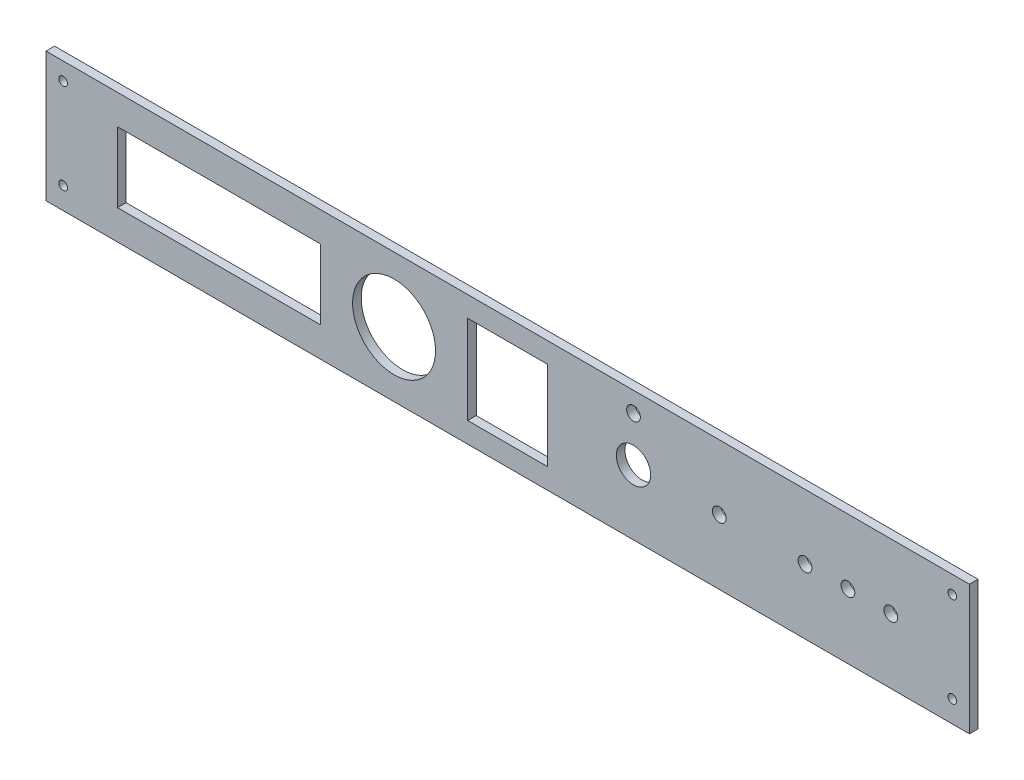
ISO-10303-21;
HEADER;
FILE_DESCRIPTION(('STEP AP214'),'2;1');
FILE_NAME('part.step','',(''),(''),'','','');
FILE_SCHEMA(('AUTOMOTIVE_DESIGN { 1 0 10303 214 1 1 1 1 }'));
ENDSEC;
DATA;
#1=APPLICATION_CONTEXT('core data for automotive mechanical design processes');
#2=APPLICATION_PROTOCOL_DEFINITION('international standard','automotive_design',2000,#1);
#3=PRODUCT_CONTEXT('',#1,'mechanical');
#4=PRODUCT('Part','Part','',(#3));
#5=PRODUCT_RELATED_PRODUCT_CATEGORY('part','',(#4));
#6=PRODUCT_DEFINITION_FORMATION('','',#4);
#7=PRODUCT_DEFINITION_CONTEXT('part definition',#1,'design');
#8=PRODUCT_DEFINITION('design','',#6,#7);
#9=PRODUCT_DEFINITION_SHAPE('','',#8);
#10=(LENGTH_UNIT() NAMED_UNIT(*) SI_UNIT(.MILLI.,.METRE.));
#11=(NAMED_UNIT(*) PLANE_ANGLE_UNIT() SI_UNIT($,.RADIAN.));
#12=(NAMED_UNIT(*) SI_UNIT($,.STERADIAN.) SOLID_ANGLE_UNIT());
#13=UNCERTAINTY_MEASURE_WITH_UNIT(LENGTH_MEASURE(1.E-05),#10,'distance_accuracy_value','');
#14=(GEOMETRIC_REPRESENTATION_CONTEXT(3) GLOBAL_UNCERTAINTY_ASSIGNED_CONTEXT((#13)) GLOBAL_UNIT_ASSIGNED_CONTEXT((#10,
#11,#12)) REPRESENTATION_CONTEXT('',''));
#15=CARTESIAN_POINT('',(0.,0.,0.));
#16=DIRECTION('',(0.,0.,1.));
#17=DIRECTION('',(1.,0.,0.));
#18=AXIS2_PLACEMENT_3D('',#15,#16,#17);
#19=CARTESIAN_POINT('',(0.,0.,3.));
#20=DIRECTION('',(0.,0.,1.));
#21=DIRECTION('',(1.,0.,0.));
#22=AXIS2_PLACEMENT_3D('',#19,#20,#21);
#23=PLANE('',#22);
#24=CARTESIAN_POINT('',(104.,0.,3.));
#25=DIRECTION('',(0.,0.,1.));
#26=DIRECTION('',(1.,0.,0.));
#27=AXIS2_PLACEMENT_3D('',#24,#25,#26);
#28=CIRCLE('',#27,2.4);
#29=CARTESIAN_POINT('',(106.4,0.,3.));
#30=VERTEX_POINT('',#29);
#31=EDGE_CURVE('E360',#30,#30,#28,.T.);
#32=ORIENTED_EDGE('',*,*,#31,.F.);
#33=EDGE_LOOP('',(#32));
#34=FACE_BOUND('',#33,.T.);
#35=CARTESIAN_POINT('',(134.,0.,3.));
#36=DIRECTION('',(0.,0.,1.));
#37=DIRECTION('',(1.,0.,0.));
#38=AXIS2_PLACEMENT_3D('',#35,#36,#37);
#39=CIRCLE('',#38,2.4);
#40=CARTESIAN_POINT('',(136.4,0.,3.));
#41=VERTEX_POINT('',#40);
#42=EDGE_CURVE('E366',#41,#41,#39,.T.);
#43=ORIENTED_EDGE('',*,*,#42,.F.);
#44=EDGE_LOOP('',(#43));
#45=FACE_BOUND('',#44,.T.);
#46=CARTESIAN_POINT('',(-39.75,0.,3.));
#47=DIRECTION('',(0.,0.,1.));
#48=DIRECTION('',(1.,0.,0.));
#49=AXIS2_PLACEMENT_3D('',#46,#47,#48);
#50=CIRCLE('',#49,14.5);
#51=CARTESIAN_POINT('',(-25.25,0.,3.));
#52=VERTEX_POINT('',#51);
#53=EDGE_CURVE('E372',#52,#52,#50,.T.);
#54=ORIENTED_EDGE('',*,*,#53,.F.);
#55=EDGE_LOOP('',(#54));
#56=FACE_BOUND('',#55,.T.);
#57=DIRECTION('',(1.,0.,0.));
#58=VECTOR('',#57,1.);
#59=CARTESIAN_POINT('',(0.,15.5,3.));
#60=LINE('',#59,#58);
#61=CARTESIAN_POINT('',(-14.,15.5,3.));
#62=VERTEX_POINT('',#61);
#63=CARTESIAN_POINT('',(14.,15.5,3.));
#64=VERTEX_POINT('',#63);
#65=EDGE_CURVE('E174',#62,#64,#60,.T.);
#66=ORIENTED_EDGE('',*,*,#65,.T.);
#67=DIRECTION('',(0.,-1.,0.));
#68=VECTOR('',#67,1.);
#69=CARTESIAN_POINT('',(14.,0.,3.));
#70=LINE('',#69,#68);
#71=CARTESIAN_POINT('',(14.,-15.5,3.));
#72=VERTEX_POINT('',#71);
#73=EDGE_CURVE('E78',#64,#72,#70,.T.);
#74=ORIENTED_EDGE('',*,*,#73,.T.);
#75=DIRECTION('',(1.,0.,0.));
#76=VECTOR('',#75,1.);
#77=CARTESIAN_POINT('',(0.,-15.5,3.));
#78=LINE('',#77,#76);
#79=CARTESIAN_POINT('',(-14.,-15.5,3.));
#80=VERTEX_POINT('',#79);
#81=EDGE_CURVE('E164',#80,#72,#78,.T.);
#82=ORIENTED_EDGE('',*,*,#81,.F.);
#83=DIRECTION('',(0.,-1.,0.));
#84=VECTOR('',#83,1.);
#85=CARTESIAN_POINT('',(-14.,0.,3.));
#86=LINE('',#85,#84);
#87=EDGE_CURVE('E169',#62,#80,#86,.T.);
#88=ORIENTED_EDGE('',*,*,#87,.F.);
#89=EDGE_LOOP('',(#66,#74,#82,#88));
#90=FACE_BOUND('',#89,.T.);
#91=CARTESIAN_POINT('',(155.5,16.55,3.));
#92=DIRECTION('',(0.,0.,1.));
#93=DIRECTION('',(1.,0.,0.));
#94=AXIS2_PLACEMENT_3D('',#91,#92,#93);
#95=CIRCLE('',#94,1.49999999999994);
#96=CARTESIAN_POINT('',(157.,16.55,3.));
#97=VERTEX_POINT('',#96);
#98=EDGE_CURVE('E350',#97,#97,#95,.F.);
#99=ORIENTED_EDGE('',*,*,#98,.T.);
#100=EDGE_LOOP('',(#99));
#101=FACE_BOUND('',#100,.T.);
#102=CARTESIAN_POINT('',(74.,0.,3.));
#103=DIRECTION('',(0.,0.,1.));
#104=DIRECTION('',(1.,0.,0.));
#105=AXIS2_PLACEMENT_3D('',#102,#103,#104);
#106=CIRCLE('',#105,2.4);
#107=CARTESIAN_POINT('',(76.4,0.,3.));
#108=VERTEX_POINT('',#107);
#109=EDGE_CURVE('E462',#108,#108,#106,.T.);
#110=ORIENTED_EDGE('',*,*,#109,.F.);
#111=EDGE_LOOP('',(#110));
#112=FACE_BOUND('',#111,.T.);
#113=CARTESIAN_POINT('',(-155.5,-15.05,3.));
#114=DIRECTION('',(0.,0.,1.));
#115=DIRECTION('',(1.,0.,0.));
#116=AXIS2_PLACEMENT_3D('',#113,#114,#115);
#117=CIRCLE('',#116,1.49999999999994);
#118=CARTESIAN_POINT('',(-154.,-15.05,3.));
#119=VERTEX_POINT('',#118);
#120=EDGE_CURVE('E466',#119,#119,#117,.T.);
#121=ORIENTED_EDGE('',*,*,#120,.F.);
#122=EDGE_LOOP('',(#121));
#123=FACE_BOUND('',#122,.T.);
#124=CARTESIAN_POINT('',(-155.5,16.55,3.));
#125=DIRECTION('',(0.,0.,1.));
#126=DIRECTION('',(1.,0.,0.));
#127=AXIS2_PLACEMENT_3D('',#124,#125,#126);
#128=CIRCLE('',#127,1.49999999999994);
#129=CARTESIAN_POINT('',(-154.,16.55,3.));
#130=VERTEX_POINT('',#129);
#131=EDGE_CURVE('E469',#130,#130,#128,.T.);
#132=ORIENTED_EDGE('',*,*,#131,.F.);
#133=EDGE_LOOP('',(#132));
#134=FACE_BOUND('',#133,.T.);
#135=DIRECTION('',(1.,0.,0.));
#136=VECTOR('',#135,1.);
#137=CARTESIAN_POINT('',(0.,-12.25,3.));
#138=LINE('',#137,#136);
#139=CARTESIAN_POINT('',(-136.5,-12.25,3.));
#140=VERTEX_POINT('',#139);
#141=CARTESIAN_POINT('',(-65.5,-12.25,3.));
#142=VERTEX_POINT('',#141);
#143=EDGE_CURVE('E86',#140,#142,#138,.T.);
#144=ORIENTED_EDGE('',*,*,#143,.F.);
#145=DIRECTION('',(0.,-1.,0.));
#146=VECTOR('',#145,1.);
#147=CARTESIAN_POINT('',(-136.5,0.,3.));
#148=LINE('',#147,#146);
#149=CARTESIAN_POINT('',(-136.5,12.25,3.));
#150=VERTEX_POINT('',#149);
#151=EDGE_CURVE('E212',#150,#140,#148,.T.);
#152=ORIENTED_EDGE('',*,*,#151,.F.);
#153=DIRECTION('',(1.,0.,0.));
#154=VECTOR('',#153,1.);
#155=CARTESIAN_POINT('',(0.,12.25,3.));
#156=LINE('',#155,#154);
#157=CARTESIAN_POINT('',(-65.5,12.25,3.));
#158=VERTEX_POINT('',#157);
#159=EDGE_CURVE('E178',#150,#158,#156,.T.);
#160=ORIENTED_EDGE('',*,*,#159,.T.);
#161=DIRECTION('',(0.,-1.,0.));
#162=VECTOR('',#161,1.);
#163=CARTESIAN_POINT('',(-65.5,0.,3.));
#164=LINE('',#163,#162);
#165=EDGE_CURVE('E175',#158,#142,#164,.T.);
#166=ORIENTED_EDGE('',*,*,#165,.T.);
#167=EDGE_LOOP('',(#144,#152,#160,#166));
#168=FACE_BOUND('',#167,.T.);
#169=DIRECTION('',(0.,1.,0.));
#170=VECTOR('',#169,1.);
#171=CARTESIAN_POINT('',(161.5,22.67,3.));
#172=LINE('',#171,#170);
#173=CARTESIAN_POINT('',(161.5,-22.67,3.));
#174=VERTEX_POINT('',#173);
#175=CARTESIAN_POINT('',(161.5,22.67,3.));
#176=VERTEX_POINT('',#175);
#177=EDGE_CURVE('E224',#174,#176,#172,.T.);
#178=ORIENTED_EDGE('',*,*,#177,.T.);
#179=DIRECTION('',(-1.,0.,0.));
#180=VECTOR('',#179,1.);
#181=CARTESIAN_POINT('',(-161.5,22.67,3.));
#182=LINE('',#181,#180);
#183=CARTESIAN_POINT('',(-161.5,22.67,3.));
#184=VERTEX_POINT('',#183);
#185=EDGE_CURVE('E227',#176,#184,#182,.T.);
#186=ORIENTED_EDGE('',*,*,#185,.T.);
#187=DIRECTION('',(0.,-1.,0.));
#188=VECTOR('',#187,1.);
#189=CARTESIAN_POINT('',(-161.5,22.67,3.));
#190=LINE('',#189,#188);
#191=CARTESIAN_POINT('',(-161.5,-22.67,3.));
#192=VERTEX_POINT('',#191);
#193=EDGE_CURVE('E230',#184,#192,#190,.T.);
#194=ORIENTED_EDGE('',*,*,#193,.T.);
#195=DIRECTION('',(1.,0.,0.));
#196=VECTOR('',#195,1.);
#197=CARTESIAN_POINT('',(-161.5,-22.67,3.));
#198=LINE('',#197,#196);
#199=EDGE_CURVE('E232',#192,#174,#198,.T.);
#200=ORIENTED_EDGE('',*,*,#199,.T.);
#201=EDGE_LOOP('',(#178,#186,#194,#200));
#202=FACE_BOUND('',#201,.T.);
#203=CARTESIAN_POINT('',(119.,0.,3.));
#204=DIRECTION('',(0.,0.,1.));
#205=DIRECTION('',(1.,0.,0.));
#206=AXIS2_PLACEMENT_3D('',#203,#204,#205);
#207=CIRCLE('',#206,2.4);
#208=CARTESIAN_POINT('',(121.4,0.,3.));
#209=VERTEX_POINT('',#208);
#210=EDGE_CURVE('E376',#209,#209,#207,.T.);
#211=ORIENTED_EDGE('',*,*,#210,.F.);
#212=EDGE_LOOP('',(#211));
#213=FACE_BOUND('',#212,.T.);
#214=CARTESIAN_POINT('',(44.,15.67,3.));
#215=DIRECTION('',(0.,0.,1.));
#216=DIRECTION('',(1.,0.,0.));
#217=AXIS2_PLACEMENT_3D('',#214,#215,#216);
#218=CIRCLE('',#217,2.4);
#219=CARTESIAN_POINT('',(46.4,15.67,3.));
#220=VERTEX_POINT('',#219);
#221=EDGE_CURVE('E197',#220,#220,#218,.T.);
#222=ORIENTED_EDGE('',*,*,#221,.F.);
#223=EDGE_LOOP('',(#222));
#224=FACE_BOUND('',#223,.T.);
#225=CARTESIAN_POINT('',(44.,0.,3.));
#226=DIRECTION('',(0.,0.,1.));
#227=DIRECTION('',(1.,0.,0.));
#228=AXIS2_PLACEMENT_3D('',#225,#226,#227);
#229=CIRCLE('',#228,6.);
#230=CARTESIAN_POINT('',(50.,0.,3.));
#231=VERTEX_POINT('',#230);
#232=EDGE_CURVE('E161',#231,#231,#229,.T.);
#233=ORIENTED_EDGE('',*,*,#232,.F.);
#234=EDGE_LOOP('',(#233));
#235=FACE_BOUND('',#234,.T.);
#236=CARTESIAN_POINT('',(155.5,-15.05,3.));
#237=DIRECTION('',(0.,0.,1.));
#238=DIRECTION('',(1.,0.,0.));
#239=AXIS2_PLACEMENT_3D('',#236,#237,#238);
#240=CIRCLE('',#239,1.49999999999994);
#241=CARTESIAN_POINT('',(157.,-15.05,3.));
#242=VERTEX_POINT('',#241);
#243=EDGE_CURVE('E349',#242,#242,#240,.F.);
#244=ORIENTED_EDGE('',*,*,#243,.T.);
#245=EDGE_LOOP('',(#244));
#246=FACE_BOUND('',#245,.T.);
#247=ADVANCED_FACE('F63',(#34,#45,#56,#90,#101,#112,#123,#134,#168,#202,#213,#224,#235,#246),
#23,.T.);
#248=CARTESIAN_POINT('',(0.,0.,0.));
#249=DIRECTION('',(0.,0.,1.));
#250=DIRECTION('',(1.,0.,0.));
#251=AXIS2_PLACEMENT_3D('',#248,#249,#250);
#252=PLANE('',#251);
#253=CARTESIAN_POINT('',(104.,0.,0.));
#254=DIRECTION('',(0.,0.,1.));
#255=DIRECTION('',(1.,0.,0.));
#256=AXIS2_PLACEMENT_3D('',#253,#254,#255);
#257=CIRCLE('',#256,2.4);
#258=CARTESIAN_POINT('',(106.4,0.,0.));
#259=VERTEX_POINT('',#258);
#260=EDGE_CURVE('E363',#259,#259,#257,.T.);
#261=ORIENTED_EDGE('',*,*,#260,.T.);
#262=EDGE_LOOP('',(#261));
#263=FACE_BOUND('',#262,.T.);
#264=CARTESIAN_POINT('',(134.,0.,0.));
#265=DIRECTION('',(0.,0.,1.));
#266=DIRECTION('',(1.,0.,0.));
#267=AXIS2_PLACEMENT_3D('',#264,#265,#266);
#268=CIRCLE('',#267,2.4);
#269=CARTESIAN_POINT('',(136.4,0.,0.));
#270=VERTEX_POINT('',#269);
#271=EDGE_CURVE('E369',#270,#270,#268,.T.);
#272=ORIENTED_EDGE('',*,*,#271,.T.);
#273=EDGE_LOOP('',(#272));
#274=FACE_BOUND('',#273,.T.);
#275=CARTESIAN_POINT('',(-39.75,0.,0.));
#276=DIRECTION('',(0.,0.,1.));
#277=DIRECTION('',(1.,0.,0.));
#278=AXIS2_PLACEMENT_3D('',#275,#276,#277);
#279=CIRCLE('',#278,14.5);
#280=CARTESIAN_POINT('',(-25.25,0.,0.));
#281=VERTEX_POINT('',#280);
#282=EDGE_CURVE('E353',#281,#281,#279,.T.);
#283=ORIENTED_EDGE('',*,*,#282,.T.);
#284=EDGE_LOOP('',(#283));
#285=FACE_BOUND('',#284,.T.);
#286=CARTESIAN_POINT('',(155.5,16.55,0.));
#287=DIRECTION('',(0.,0.,1.));
#288=DIRECTION('',(1.,0.,0.));
#289=AXIS2_PLACEMENT_3D('',#286,#287,#288);
#290=CIRCLE('',#289,1.49999999999994);
#291=CARTESIAN_POINT('',(157.,16.55,0.));
#292=VERTEX_POINT('',#291);
#293=EDGE_CURVE('E356',#292,#292,#290,.F.);
#294=ORIENTED_EDGE('',*,*,#293,.F.);
#295=EDGE_LOOP('',(#294));
#296=FACE_BOUND('',#295,.T.);
#297=DIRECTION('',(0.,1.,0.));
#298=VECTOR('',#297,1.);
#299=CARTESIAN_POINT('',(161.5,22.67,0.));
#300=LINE('',#299,#298);
#301=CARTESIAN_POINT('',(161.5,-22.67,0.));
#302=VERTEX_POINT('',#301);
#303=CARTESIAN_POINT('',(161.5,22.67,0.));
#304=VERTEX_POINT('',#303);
#305=EDGE_CURVE('E218',#302,#304,#300,.T.);
#306=ORIENTED_EDGE('',*,*,#305,.F.);
#307=DIRECTION('',(1.,0.,0.));
#308=VECTOR('',#307,1.);
#309=CARTESIAN_POINT('',(-161.5,-22.67,0.));
#310=LINE('',#309,#308);
#311=CARTESIAN_POINT('',(-161.5,-22.67,0.));
#312=VERTEX_POINT('',#311);
#313=EDGE_CURVE('E228',#312,#302,#310,.T.);
#314=ORIENTED_EDGE('',*,*,#313,.F.);
#315=DIRECTION('',(0.,-1.,0.));
#316=VECTOR('',#315,1.);
#317=CARTESIAN_POINT('',(-161.5,22.67,0.));
#318=LINE('',#317,#316);
#319=CARTESIAN_POINT('',(-161.5,22.67,0.));
#320=VERTEX_POINT('',#319);
#321=EDGE_CURVE('E239',#320,#312,#318,.T.);
#322=ORIENTED_EDGE('',*,*,#321,.F.);
#323=DIRECTION('',(-1.,0.,0.));
#324=VECTOR('',#323,1.);
#325=CARTESIAN_POINT('',(-161.5,22.67,0.));
#326=LINE('',#325,#324);
#327=EDGE_CURVE('E237',#304,#320,#326,.T.);
#328=ORIENTED_EDGE('',*,*,#327,.F.);
#329=EDGE_LOOP('',(#306,#314,#322,#328));
#330=FACE_BOUND('',#329,.T.);
#331=DIRECTION('',(0.,-1.,0.));
#332=VECTOR('',#331,1.);
#333=CARTESIAN_POINT('',(-136.5,0.,0.));
#334=LINE('',#333,#332);
#335=CARTESIAN_POINT('',(-136.5,12.25,0.));
#336=VERTEX_POINT('',#335);
#337=CARTESIAN_POINT('',(-136.5,-12.25,0.));
#338=VERTEX_POINT('',#337);
#339=EDGE_CURVE('E203',#336,#338,#334,.T.);
#340=ORIENTED_EDGE('',*,*,#339,.T.);
#341=DIRECTION('',(1.,0.,0.));
#342=VECTOR('',#341,1.);
#343=CARTESIAN_POINT('',(0.,-12.25,0.));
#344=LINE('',#343,#342);
#345=CARTESIAN_POINT('',(-65.5,-12.25,0.));
#346=VERTEX_POINT('',#345);
#347=EDGE_CURVE('E206',#338,#346,#344,.T.);
#348=ORIENTED_EDGE('',*,*,#347,.T.);
#349=DIRECTION('',(0.,-1.,0.));
#350=VECTOR('',#349,1.);
#351=CARTESIAN_POINT('',(-65.5,0.,0.));
#352=LINE('',#351,#350);
#353=CARTESIAN_POINT('',(-65.5,12.25,0.));
#354=VERTEX_POINT('',#353);
#355=EDGE_CURVE('E198',#354,#346,#352,.T.);
#356=ORIENTED_EDGE('',*,*,#355,.F.);
#357=DIRECTION('',(1.,0.,0.));
#358=VECTOR('',#357,1.);
#359=CARTESIAN_POINT('',(0.,12.25,0.));
#360=LINE('',#359,#358);
#361=EDGE_CURVE('E200',#336,#354,#360,.T.);
#362=ORIENTED_EDGE('',*,*,#361,.F.);
#363=EDGE_LOOP('',(#340,#348,#356,#362));
#364=FACE_BOUND('',#363,.T.);
#365=CARTESIAN_POINT('',(-155.5,16.55,0.));
#366=DIRECTION('',(0.,0.,1.));
#367=DIRECTION('',(1.,0.,0.));
#368=AXIS2_PLACEMENT_3D('',#365,#366,#367);
#369=CIRCLE('',#368,1.49999999999994);
#370=CARTESIAN_POINT('',(-154.,16.55,0.));
#371=VERTEX_POINT('',#370);
#372=EDGE_CURVE('E324',#371,#371,#369,.T.);
#373=ORIENTED_EDGE('',*,*,#372,.T.);
#374=EDGE_LOOP('',(#373));
#375=FACE_BOUND('',#374,.T.);
#376=CARTESIAN_POINT('',(-155.5,-15.05,0.));
#377=DIRECTION('',(0.,0.,1.));
#378=DIRECTION('',(1.,0.,0.));
#379=AXIS2_PLACEMENT_3D('',#376,#377,#378);
#380=CIRCLE('',#379,1.49999999999994);
#381=CARTESIAN_POINT('',(-154.,-15.05,0.));
#382=VERTEX_POINT('',#381);
#383=EDGE_CURVE('E328',#382,#382,#380,.T.);
#384=ORIENTED_EDGE('',*,*,#383,.T.);
#385=EDGE_LOOP('',(#384));
#386=FACE_BOUND('',#385,.T.);
#387=CARTESIAN_POINT('',(74.,0.,0.));
#388=DIRECTION('',(0.,0.,1.));
#389=DIRECTION('',(1.,0.,0.));
#390=AXIS2_PLACEMENT_3D('',#387,#388,#389);
#391=CIRCLE('',#390,2.4);
#392=CARTESIAN_POINT('',(76.4,0.,0.));
#393=VERTEX_POINT('',#392);
#394=EDGE_CURVE('E332',#393,#393,#391,.T.);
#395=ORIENTED_EDGE('',*,*,#394,.T.);
#396=EDGE_LOOP('',(#395));
#397=FACE_BOUND('',#396,.T.);
#398=CARTESIAN_POINT('',(119.,0.,0.));
#399=DIRECTION('',(0.,0.,1.));
#400=DIRECTION('',(1.,0.,0.));
#401=AXIS2_PLACEMENT_3D('',#398,#399,#400);
#402=CIRCLE('',#401,2.4);
#403=CARTESIAN_POINT('',(121.4,0.,0.));
#404=VERTEX_POINT('',#403);
#405=EDGE_CURVE('E336',#404,#404,#402,.T.);
#406=ORIENTED_EDGE('',*,*,#405,.T.);
#407=EDGE_LOOP('',(#406));
#408=FACE_BOUND('',#407,.T.);
#409=CARTESIAN_POINT('',(44.,15.67,0.));
#410=DIRECTION('',(0.,0.,1.));
#411=DIRECTION('',(1.,0.,0.));
#412=AXIS2_PLACEMENT_3D('',#409,#410,#411);
#413=CIRCLE('',#412,2.4);
#414=CARTESIAN_POINT('',(46.4,15.67,0.));
#415=VERTEX_POINT('',#414);
#416=EDGE_CURVE('E340',#415,#415,#413,.T.);
#417=ORIENTED_EDGE('',*,*,#416,.T.);
#418=EDGE_LOOP('',(#417));
#419=FACE_BOUND('',#418,.T.);
#420=CARTESIAN_POINT('',(44.,0.,0.));
#421=DIRECTION('',(0.,0.,1.));
#422=DIRECTION('',(1.,0.,0.));
#423=AXIS2_PLACEMENT_3D('',#420,#421,#422);
#424=CIRCLE('',#423,6.);
#425=CARTESIAN_POINT('',(50.,0.,0.));
#426=VERTEX_POINT('',#425);
#427=EDGE_CURVE('E194',#426,#426,#424,.T.);
#428=ORIENTED_EDGE('',*,*,#427,.T.);
#429=EDGE_LOOP('',(#428));
#430=FACE_BOUND('',#429,.T.);
#431=DIRECTION('',(0.,-1.,0.));
#432=VECTOR('',#431,1.);
#433=CARTESIAN_POINT('',(14.,0.,0.));
#434=LINE('',#433,#432);
#435=CARTESIAN_POINT('',(14.,15.5,0.));
#436=VERTEX_POINT('',#435);
#437=CARTESIAN_POINT('',(14.,-15.5,0.));
#438=VERTEX_POINT('',#437);
#439=EDGE_CURVE('E156',#436,#438,#434,.T.);
#440=ORIENTED_EDGE('',*,*,#439,.F.);
#441=DIRECTION('',(1.,0.,0.));
#442=VECTOR('',#441,1.);
#443=CARTESIAN_POINT('',(0.,15.5,0.));
#444=LINE('',#443,#442);
#445=CARTESIAN_POINT('',(-14.,15.5,0.));
#446=VERTEX_POINT('',#445);
#447=EDGE_CURVE('E189',#446,#436,#444,.T.);
#448=ORIENTED_EDGE('',*,*,#447,.F.);
#449=DIRECTION('',(0.,-1.,0.));
#450=VECTOR('',#449,1.);
#451=CARTESIAN_POINT('',(-14.,0.,0.));
#452=LINE('',#451,#450);
#453=CARTESIAN_POINT('',(-14.,-15.5,0.));
#454=VERTEX_POINT('',#453);
#455=EDGE_CURVE('E185',#446,#454,#452,.T.);
#456=ORIENTED_EDGE('',*,*,#455,.T.);
#457=DIRECTION('',(1.,0.,0.));
#458=VECTOR('',#457,1.);
#459=CARTESIAN_POINT('',(0.,-15.5,0.));
#460=LINE('',#459,#458);
#461=EDGE_CURVE('E183',#454,#438,#460,.T.);
#462=ORIENTED_EDGE('',*,*,#461,.T.);
#463=EDGE_LOOP('',(#440,#448,#456,#462));
#464=FACE_BOUND('',#463,.T.);
#465=CARTESIAN_POINT('',(155.5,-15.05,0.));
#466=DIRECTION('',(0.,0.,1.));
#467=DIRECTION('',(1.,0.,0.));
#468=AXIS2_PLACEMENT_3D('',#465,#466,#467);
#469=CIRCLE('',#468,1.49999999999994);
#470=CARTESIAN_POINT('',(157.,-15.05,0.));
#471=VERTEX_POINT('',#470);
#472=EDGE_CURVE('E347',#471,#471,#469,.F.);
#473=ORIENTED_EDGE('',*,*,#472,.F.);
#474=EDGE_LOOP('',(#473));
#475=FACE_BOUND('',#474,.T.);
#476=ADVANCED_FACE('F257',(#263,#274,#285,#296,#330,#364,#375,#386,#397,#408,#419,#430,#464,
#475),#252,.F.);
#477=CARTESIAN_POINT('',(161.5,22.67,3.));
#478=DIRECTION('',(-1.,0.,0.));
#479=DIRECTION('',(0.,0.,1.));
#480=AXIS2_PLACEMENT_3D('',#477,#478,#479);
#481=PLANE('',#480);
#482=ORIENTED_EDGE('',*,*,#305,.T.);
#483=DIRECTION('',(0.,0.,-1.));
#484=VECTOR('',#483,1.);
#485=CARTESIAN_POINT('',(161.5,22.67,3.));
#486=LINE('',#485,#484);
#487=EDGE_CURVE('E12',#176,#304,#486,.T.);
#488=ORIENTED_EDGE('',*,*,#487,.F.);
#489=ORIENTED_EDGE('',*,*,#177,.F.);
#490=DIRECTION('',(0.,0.,-1.));
#491=VECTOR('',#490,1.);
#492=CARTESIAN_POINT('',(161.5,-22.67,3.));
#493=LINE('',#492,#491);
#494=EDGE_CURVE('E234',#174,#302,#493,.T.);
#495=ORIENTED_EDGE('',*,*,#494,.T.);
#496=EDGE_LOOP('',(#482,#488,#489,#495));
#497=FACE_BOUND('',#496,.T.);
#498=ADVANCED_FACE('F65',(#497),#481,.F.);
#499=CARTESIAN_POINT('',(-161.5,22.67,3.));
#500=DIRECTION('',(0.,-1.,0.));
#501=DIRECTION('',(0.,0.,-1.));
#502=AXIS2_PLACEMENT_3D('',#499,#500,#501);
#503=PLANE('',#502);
#504=ORIENTED_EDGE('',*,*,#327,.T.);
#505=DIRECTION('',(0.,0.,-1.));
#506=VECTOR('',#505,1.);
#507=CARTESIAN_POINT('',(-161.5,22.67,3.));
#508=LINE('',#507,#506);
#509=EDGE_CURVE('E71',#184,#320,#508,.T.);
#510=ORIENTED_EDGE('',*,*,#509,.F.);
#511=ORIENTED_EDGE('',*,*,#185,.F.);
#512=ORIENTED_EDGE('',*,*,#487,.T.);
#513=EDGE_LOOP('',(#504,#510,#511,#512));
#514=FACE_BOUND('',#513,.T.);
#515=ADVANCED_FACE('F268',(#514),#503,.F.);
#516=CARTESIAN_POINT('',(-161.5,22.67,3.));
#517=DIRECTION('',(1.,0.,0.));
#518=DIRECTION('',(0.,0.,-1.));
#519=AXIS2_PLACEMENT_3D('',#516,#517,#518);
#520=PLANE('',#519);
#521=ORIENTED_EDGE('',*,*,#321,.T.);
#522=DIRECTION('',(0.,0.,-1.));
#523=VECTOR('',#522,1.);
#524=CARTESIAN_POINT('',(-161.5,-22.67,3.));
#525=LINE('',#524,#523);
#526=EDGE_CURVE('E244',#192,#312,#525,.T.);
#527=ORIENTED_EDGE('',*,*,#526,.F.);
#528=ORIENTED_EDGE('',*,*,#193,.F.);
#529=ORIENTED_EDGE('',*,*,#509,.T.);
#530=EDGE_LOOP('',(#521,#527,#528,#529));
#531=FACE_BOUND('',#530,.T.);
#532=ADVANCED_FACE('F251',(#531),#520,.F.);
#533=CARTESIAN_POINT('',(-161.5,-22.67,3.));
#534=DIRECTION('',(0.,1.,0.));
#535=DIRECTION('',(0.,0.,1.));
#536=AXIS2_PLACEMENT_3D('',#533,#534,#535);
#537=PLANE('',#536);
#538=ORIENTED_EDGE('',*,*,#313,.T.);
#539=ORIENTED_EDGE('',*,*,#494,.F.);
#540=ORIENTED_EDGE('',*,*,#199,.F.);
#541=ORIENTED_EDGE('',*,*,#526,.T.);
#542=EDGE_LOOP('',(#538,#539,#540,#541));
#543=FACE_BOUND('',#542,.T.);
#544=ADVANCED_FACE('F261',(#543),#537,.F.);
#545=CARTESIAN_POINT('',(0.,-12.25,0.));
#546=DIRECTION('',(0.,-1.,0.));
#547=DIRECTION('',(1.,0.,0.));
#548=AXIS2_PLACEMENT_3D('',#545,#546,#547);
#549=PLANE('',#548);
#550=ORIENTED_EDGE('',*,*,#143,.T.);
#551=DIRECTION('',(0.,0.,1.));
#552=VECTOR('',#551,1.);
#553=CARTESIAN_POINT('',(-65.5,-12.25,0.));
#554=LINE('',#553,#552);
#555=EDGE_CURVE('E216',#346,#142,#554,.T.);
#556=ORIENTED_EDGE('',*,*,#555,.F.);
#557=ORIENTED_EDGE('',*,*,#347,.F.);
#558=DIRECTION('',(0.,0.,1.));
#559=VECTOR('',#558,1.);
#560=CARTESIAN_POINT('',(-136.5,-12.25,0.));
#561=LINE('',#560,#559);
#562=EDGE_CURVE('E219',#338,#140,#561,.T.);
#563=ORIENTED_EDGE('',*,*,#562,.T.);
#564=EDGE_LOOP('',(#550,#556,#557,#563));
#565=FACE_BOUND('',#564,.T.);
#566=ADVANCED_FACE('F290',(#565),#549,.F.);
#567=CARTESIAN_POINT('',(-136.5,0.,0.));
#568=DIRECTION('',(-1.,0.,0.));
#569=DIRECTION('',(0.,0.,1.));
#570=AXIS2_PLACEMENT_3D('',#567,#568,#569);
#571=PLANE('',#570);
#572=ORIENTED_EDGE('',*,*,#151,.T.);
#573=ORIENTED_EDGE('',*,*,#562,.F.);
#574=ORIENTED_EDGE('',*,*,#339,.F.);
#575=DIRECTION('',(0.,0.,1.));
#576=VECTOR('',#575,1.);
#577=CARTESIAN_POINT('',(-136.5,12.25,0.));
#578=LINE('',#577,#576);
#579=EDGE_CURVE('E221',#336,#150,#578,.T.);
#580=ORIENTED_EDGE('',*,*,#579,.T.);
#581=EDGE_LOOP('',(#572,#573,#574,#580));
#582=FACE_BOUND('',#581,.T.);
#583=ADVANCED_FACE('F294',(#582),#571,.F.);
#584=CARTESIAN_POINT('',(0.,12.25,0.));
#585=DIRECTION('',(0.,-1.,0.));
#586=DIRECTION('',(1.,0.,0.));
#587=AXIS2_PLACEMENT_3D('',#584,#585,#586);
#588=PLANE('',#587);
#589=ORIENTED_EDGE('',*,*,#159,.F.);
#590=ORIENTED_EDGE('',*,*,#579,.F.);
#591=ORIENTED_EDGE('',*,*,#361,.T.);
#592=DIRECTION('',(0.,0.,1.));
#593=VECTOR('',#592,1.);
#594=CARTESIAN_POINT('',(-65.5,12.25,0.));
#595=LINE('',#594,#593);
#596=EDGE_CURVE('E208',#354,#158,#595,.T.);
#597=ORIENTED_EDGE('',*,*,#596,.T.);
#598=EDGE_LOOP('',(#589,#590,#591,#597));
#599=FACE_BOUND('',#598,.T.);
#600=ADVANCED_FACE('F299',(#599),#588,.T.);
#601=CARTESIAN_POINT('',(-65.5,0.,0.));
#602=DIRECTION('',(-1.,0.,0.));
#603=DIRECTION('',(0.,0.,1.));
#604=AXIS2_PLACEMENT_3D('',#601,#602,#603);
#605=PLANE('',#604);
#606=ORIENTED_EDGE('',*,*,#165,.F.);
#607=ORIENTED_EDGE('',*,*,#596,.F.);
#608=ORIENTED_EDGE('',*,*,#355,.T.);
#609=ORIENTED_EDGE('',*,*,#555,.T.);
#610=EDGE_LOOP('',(#606,#607,#608,#609));
#611=FACE_BOUND('',#610,.T.);
#612=ADVANCED_FACE('F286',(#611),#605,.T.);
#613=CARTESIAN_POINT('',(-155.5,16.55,0.));
#614=DIRECTION('',(0.,0.,1.));
#615=DIRECTION('',(1.,0.,0.));
#616=AXIS2_PLACEMENT_3D('',#613,#614,#615);
#617=CYLINDRICAL_SURFACE('',#616,1.49999999999994);
#618=ORIENTED_EDGE('',*,*,#372,.F.);
#619=EDGE_LOOP('',(#618));
#620=FACE_BOUND('',#619,.T.);
#621=ORIENTED_EDGE('',*,*,#131,.T.);
#622=EDGE_LOOP('',(#621));
#623=FACE_BOUND('',#622,.T.);
#624=ADVANCED_FACE('F310',(#620,#623),#617,.F.);
#625=CARTESIAN_POINT('',(-155.5,-15.05,0.));
#626=DIRECTION('',(0.,0.,1.));
#627=DIRECTION('',(1.,0.,0.));
#628=AXIS2_PLACEMENT_3D('',#625,#626,#627);
#629=CYLINDRICAL_SURFACE('',#628,1.49999999999994);
#630=ORIENTED_EDGE('',*,*,#383,.F.);
#631=EDGE_LOOP('',(#630));
#632=FACE_BOUND('',#631,.T.);
#633=ORIENTED_EDGE('',*,*,#120,.T.);
#634=EDGE_LOOP('',(#633));
#635=FACE_BOUND('',#634,.T.);
#636=ADVANCED_FACE('F441',(#632,#635),#629,.F.);
#637=CARTESIAN_POINT('',(74.,0.,0.));
#638=DIRECTION('',(0.,0.,1.));
#639=DIRECTION('',(1.,0.,0.));
#640=AXIS2_PLACEMENT_3D('',#637,#638,#639);
#641=CYLINDRICAL_SURFACE('',#640,2.4);
#642=ORIENTED_EDGE('',*,*,#394,.F.);
#643=EDGE_LOOP('',(#642));
#644=FACE_BOUND('',#643,.T.);
#645=ORIENTED_EDGE('',*,*,#109,.T.);
#646=EDGE_LOOP('',(#645));
#647=FACE_BOUND('',#646,.T.);
#648=ADVANCED_FACE('F445',(#644,#647),#641,.F.);
#649=CARTESIAN_POINT('',(155.5,16.55,0.));
#650=DIRECTION('',(0.,0.,1.));
#651=DIRECTION('',(1.,0.,0.));
#652=AXIS2_PLACEMENT_3D('',#649,#650,#651);
#653=CYLINDRICAL_SURFACE('',#652,1.49999999999994);
#654=ORIENTED_EDGE('',*,*,#293,.T.);
#655=EDGE_LOOP('',(#654));
#656=FACE_BOUND('',#655,.T.);
#657=ORIENTED_EDGE('',*,*,#98,.F.);
#658=EDGE_LOOP('',(#657));
#659=FACE_BOUND('',#658,.T.);
#660=ADVANCED_FACE('F424',(#656,#659),#653,.F.);
#661=CARTESIAN_POINT('',(119.,0.,0.));
#662=DIRECTION('',(0.,0.,1.));
#663=DIRECTION('',(1.,0.,0.));
#664=AXIS2_PLACEMENT_3D('',#661,#662,#663);
#665=CYLINDRICAL_SURFACE('',#664,2.4);
#666=ORIENTED_EDGE('',*,*,#405,.F.);
#667=EDGE_LOOP('',(#666));
#668=FACE_BOUND('',#667,.T.);
#669=ORIENTED_EDGE('',*,*,#210,.T.);
#670=EDGE_LOOP('',(#669));
#671=FACE_BOUND('',#670,.T.);
#672=ADVANCED_FACE('F412',(#668,#671),#665,.F.);
#673=CARTESIAN_POINT('',(44.,15.67,0.));
#674=DIRECTION('',(0.,0.,1.));
#675=DIRECTION('',(1.,0.,0.));
#676=AXIS2_PLACEMENT_3D('',#673,#674,#675);
#677=CYLINDRICAL_SURFACE('',#676,2.4);
#678=ORIENTED_EDGE('',*,*,#416,.F.);
#679=EDGE_LOOP('',(#678));
#680=FACE_BOUND('',#679,.T.);
#681=ORIENTED_EDGE('',*,*,#221,.T.);
#682=EDGE_LOOP('',(#681));
#683=FACE_BOUND('',#682,.T.);
#684=ADVANCED_FACE('F407',(#680,#683),#677,.F.);
#685=CARTESIAN_POINT('',(44.,0.,0.));
#686=DIRECTION('',(0.,0.,1.));
#687=DIRECTION('',(1.,0.,0.));
#688=AXIS2_PLACEMENT_3D('',#685,#686,#687);
#689=CYLINDRICAL_SURFACE('',#688,6.);
#690=ORIENTED_EDGE('',*,*,#427,.F.);
#691=EDGE_LOOP('',(#690));
#692=FACE_BOUND('',#691,.T.);
#693=ORIENTED_EDGE('',*,*,#232,.T.);
#694=EDGE_LOOP('',(#693));
#695=FACE_BOUND('',#694,.T.);
#696=ADVANCED_FACE('F303',(#692,#695),#689,.F.);
#697=CARTESIAN_POINT('',(14.,0.,0.));
#698=DIRECTION('',(-1.,0.,0.));
#699=DIRECTION('',(0.,-1.,0.));
#700=AXIS2_PLACEMENT_3D('',#697,#698,#699);
#701=PLANE('',#700);
#702=ORIENTED_EDGE('',*,*,#73,.F.);
#703=DIRECTION('',(0.,0.,1.));
#704=VECTOR('',#703,1.);
#705=CARTESIAN_POINT('',(14.,15.5,0.));
#706=LINE('',#705,#704);
#707=EDGE_CURVE('E186',#436,#64,#706,.T.);
#708=ORIENTED_EDGE('',*,*,#707,.F.);
#709=ORIENTED_EDGE('',*,*,#439,.T.);
#710=DIRECTION('',(0.,0.,1.));
#711=VECTOR('',#710,1.);
#712=CARTESIAN_POINT('',(14.,-15.5,0.));
#713=LINE('',#712,#711);
#714=EDGE_CURVE('E152',#438,#72,#713,.T.);
#715=ORIENTED_EDGE('',*,*,#714,.T.);
#716=EDGE_LOOP('',(#702,#708,#709,#715));
#717=FACE_BOUND('',#716,.T.);
#718=ADVANCED_FACE('F154',(#717),#701,.T.);
#719=CARTESIAN_POINT('',(0.,-15.5,0.));
#720=DIRECTION('',(0.,-1.,0.));
#721=DIRECTION('',(0.,0.,-1.));
#722=AXIS2_PLACEMENT_3D('',#719,#720,#721);
#723=PLANE('',#722);
#724=ORIENTED_EDGE('',*,*,#81,.T.);
#725=ORIENTED_EDGE('',*,*,#714,.F.);
#726=ORIENTED_EDGE('',*,*,#461,.F.);
#727=DIRECTION('',(0.,0.,1.));
#728=VECTOR('',#727,1.);
#729=CARTESIAN_POINT('',(-14.,-15.5,0.));
#730=LINE('',#729,#728);
#731=EDGE_CURVE('E160',#454,#80,#730,.T.);
#732=ORIENTED_EDGE('',*,*,#731,.T.);
#733=EDGE_LOOP('',(#724,#725,#726,#732));
#734=FACE_BOUND('',#733,.T.);
#735=ADVANCED_FACE('F165',(#734),#723,.F.);
#736=CARTESIAN_POINT('',(-14.,0.,0.));
#737=DIRECTION('',(-1.,0.,0.));
#738=DIRECTION('',(0.,-1.,0.));
#739=AXIS2_PLACEMENT_3D('',#736,#737,#738);
#740=PLANE('',#739);
#741=ORIENTED_EDGE('',*,*,#87,.T.);
#742=ORIENTED_EDGE('',*,*,#731,.F.);
#743=ORIENTED_EDGE('',*,*,#455,.F.);
#744=DIRECTION('',(0.,0.,1.));
#745=VECTOR('',#744,1.);
#746=CARTESIAN_POINT('',(-14.,15.5,0.));
#747=LINE('',#746,#745);
#748=EDGE_CURVE('E381',#446,#62,#747,.T.);
#749=ORIENTED_EDGE('',*,*,#748,.T.);
#750=EDGE_LOOP('',(#741,#742,#743,#749));
#751=FACE_BOUND('',#750,.T.);
#752=ADVANCED_FACE('F384',(#751),#740,.F.);
#753=CARTESIAN_POINT('',(0.,15.5,0.));
#754=DIRECTION('',(0.,-1.,0.));
#755=DIRECTION('',(0.,0.,-1.));
#756=AXIS2_PLACEMENT_3D('',#753,#754,#755);
#757=PLANE('',#756);
#758=ORIENTED_EDGE('',*,*,#65,.F.);
#759=ORIENTED_EDGE('',*,*,#748,.F.);
#760=ORIENTED_EDGE('',*,*,#447,.T.);
#761=ORIENTED_EDGE('',*,*,#707,.T.);
#762=EDGE_LOOP('',(#758,#759,#760,#761));
#763=FACE_BOUND('',#762,.T.);
#764=ADVANCED_FACE('F387',(#763),#757,.T.);
#765=CARTESIAN_POINT('',(155.5,-15.05,0.));
#766=DIRECTION('',(0.,0.,1.));
#767=DIRECTION('',(1.,0.,0.));
#768=AXIS2_PLACEMENT_3D('',#765,#766,#767);
#769=CYLINDRICAL_SURFACE('',#768,1.49999999999994);
#770=ORIENTED_EDGE('',*,*,#472,.T.);
#771=EDGE_LOOP('',(#770));
#772=FACE_BOUND('',#771,.T.);
#773=ORIENTED_EDGE('',*,*,#243,.F.);
#774=EDGE_LOOP('',(#773));
#775=FACE_BOUND('',#774,.T.);
#776=ADVANCED_FACE('F389',(#772,#775),#769,.F.);
#777=CARTESIAN_POINT('',(-39.75,0.,0.));
#778=DIRECTION('',(0.,0.,1.));
#779=DIRECTION('',(1.,0.,0.));
#780=AXIS2_PLACEMENT_3D('',#777,#778,#779);
#781=CYLINDRICAL_SURFACE('',#780,14.5);
#782=ORIENTED_EDGE('',*,*,#282,.F.);
#783=EDGE_LOOP('',(#782));
#784=FACE_BOUND('',#783,.T.);
#785=ORIENTED_EDGE('',*,*,#53,.T.);
#786=EDGE_LOOP('',(#785));
#787=FACE_BOUND('',#786,.T.);
#788=ADVANCED_FACE('F395',(#784,#787),#781,.F.);
#789=CARTESIAN_POINT('',(134.,0.,0.));
#790=DIRECTION('',(0.,0.,1.));
#791=DIRECTION('',(1.,0.,0.));
#792=AXIS2_PLACEMENT_3D('',#789,#790,#791);
#793=CYLINDRICAL_SURFACE('',#792,2.4);
#794=ORIENTED_EDGE('',*,*,#271,.F.);
#795=EDGE_LOOP('',(#794));
#796=FACE_BOUND('',#795,.T.);
#797=ORIENTED_EDGE('',*,*,#42,.T.);
#798=EDGE_LOOP('',(#797));
#799=FACE_BOUND('',#798,.T.);
#800=ADVANCED_FACE('F428',(#796,#799),#793,.F.);
#801=CARTESIAN_POINT('',(104.,0.,0.));
#802=DIRECTION('',(0.,0.,1.));
#803=DIRECTION('',(1.,0.,0.));
#804=AXIS2_PLACEMENT_3D('',#801,#802,#803);
#805=CYLINDRICAL_SURFACE('',#804,2.4);
#806=ORIENTED_EDGE('',*,*,#260,.F.);
#807=EDGE_LOOP('',(#806));
#808=FACE_BOUND('',#807,.T.);
#809=ORIENTED_EDGE('',*,*,#31,.T.);
#810=EDGE_LOOP('',(#809));
#811=FACE_BOUND('',#810,.T.);
#812=ADVANCED_FACE('F431',(#808,#811),#805,.F.);
#813=CLOSED_SHELL('',(#247,#476,#498,#515,#532,#544,#566,#583,#600,#612,#624,#636,#648,#660,
#672,#684,#696,#718,#735,#752,#764,#776,#788,#800,#812));
#814=MANIFOLD_SOLID_BREP('B2',#813);
#815=ADVANCED_BREP_SHAPE_REPRESENTATION('',(#18,#814),#14);
#816=SHAPE_DEFINITION_REPRESENTATION(#9,#815);
ENDSEC;
END-ISO-10303-21;
